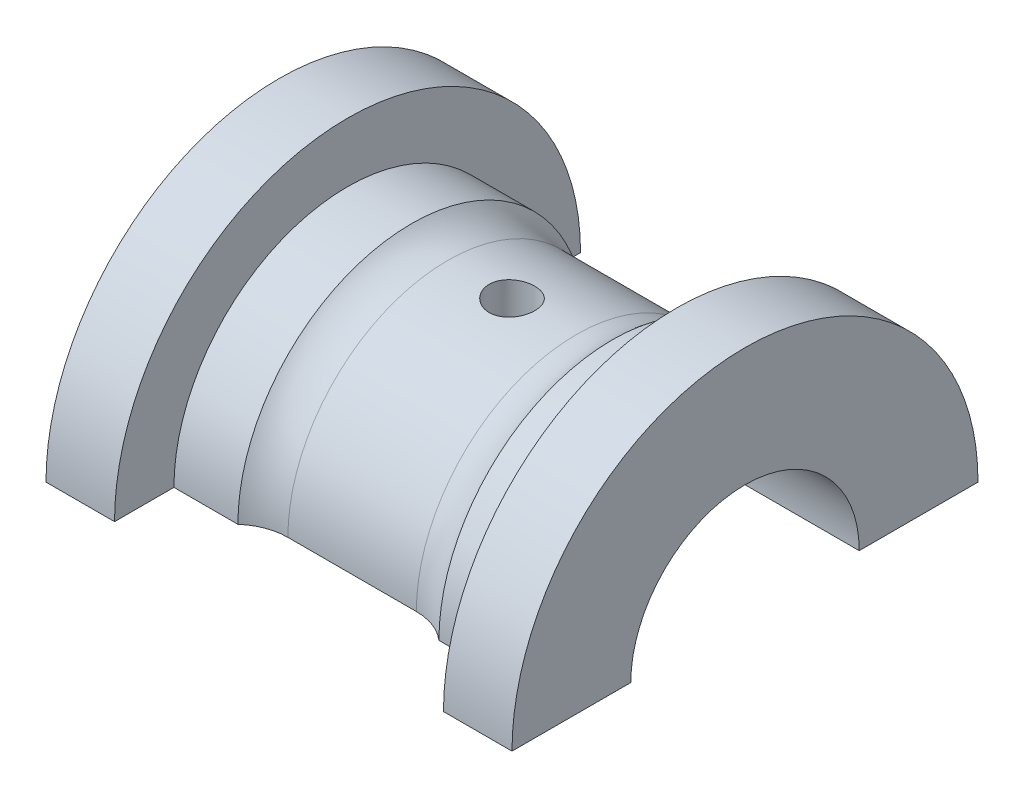
ISO-10303-21;
HEADER;
FILE_DESCRIPTION(('STEP AP214'),'2;1');
FILE_NAME('part.step','',(''),(''),'','','');
FILE_SCHEMA(('AUTOMOTIVE_DESIGN { 1 0 10303 214 1 1 1 1 }'));
ENDSEC;
DATA;
#1=APPLICATION_CONTEXT('core data for automotive mechanical design processes');
#2=APPLICATION_PROTOCOL_DEFINITION('international standard','automotive_design',2000,#1);
#3=PRODUCT_CONTEXT('',#1,'mechanical');
#4=PRODUCT('Part','Part','',(#3));
#5=PRODUCT_RELATED_PRODUCT_CATEGORY('part','',(#4));
#6=PRODUCT_DEFINITION_FORMATION('','',#4);
#7=PRODUCT_DEFINITION_CONTEXT('part definition',#1,'design');
#8=PRODUCT_DEFINITION('design','',#6,#7);
#9=PRODUCT_DEFINITION_SHAPE('','',#8);
#10=(LENGTH_UNIT() NAMED_UNIT(*) SI_UNIT(.MILLI.,.METRE.));
#11=(NAMED_UNIT(*) PLANE_ANGLE_UNIT() SI_UNIT($,.RADIAN.));
#12=(NAMED_UNIT(*) SI_UNIT($,.STERADIAN.) SOLID_ANGLE_UNIT());
#13=UNCERTAINTY_MEASURE_WITH_UNIT(LENGTH_MEASURE(1.E-05),#10,'distance_accuracy_value','');
#14=(GEOMETRIC_REPRESENTATION_CONTEXT(3) GLOBAL_UNCERTAINTY_ASSIGNED_CONTEXT((#13)) GLOBAL_UNIT_ASSIGNED_CONTEXT((#10,
#11,#12)) REPRESENTATION_CONTEXT('',''));
#15=CARTESIAN_POINT('',(0.,0.,0.));
#16=DIRECTION('',(0.,0.,1.));
#17=DIRECTION('',(1.,0.,0.));
#18=AXIS2_PLACEMENT_3D('',#15,#16,#17);
#19=CARTESIAN_POINT('',(25.5,0.,-12.5));
#20=DIRECTION('',(1.,0.,0.));
#21=DIRECTION('',(0.,0.,-1.));
#22=AXIS2_PLACEMENT_3D('',#19,#20,#21);
#23=PLANE('',#22);
#24=CARTESIAN_POINT('',(25.5,0.,0.));
#25=DIRECTION('',(1.,0.,0.));
#26=DIRECTION('',(0.,0.,-1.));
#27=AXIS2_PLACEMENT_3D('',#24,#25,#26);
#28=CIRCLE('',#27,25.5);
#29=CARTESIAN_POINT('',(25.5,0.,-25.5));
#30=VERTEX_POINT('',#29);
#31=CARTESIAN_POINT('',(25.5,0.,25.5));
#32=VERTEX_POINT('',#31);
#33=EDGE_CURVE('E120',#30,#32,#28,.T.);
#34=ORIENTED_EDGE('',*,*,#33,.T.);
#35=DIRECTION('',(0.,0.,1.));
#36=VECTOR('',#35,1.);
#37=CARTESIAN_POINT('',(25.5,0.,12.5));
#38=LINE('',#37,#36);
#39=CARTESIAN_POINT('',(25.5,0.,12.5));
#40=VERTEX_POINT('',#39);
#41=EDGE_CURVE('E122',#40,#32,#38,.T.);
#42=ORIENTED_EDGE('',*,*,#41,.F.);
#43=CARTESIAN_POINT('',(25.5,0.,0.));
#44=DIRECTION('',(1.,0.,0.));
#45=DIRECTION('',(0.,0.,-1.));
#46=AXIS2_PLACEMENT_3D('',#43,#44,#45);
#47=CIRCLE('',#46,12.5);
#48=CARTESIAN_POINT('',(25.5,0.,-12.5));
#49=VERTEX_POINT('',#48);
#50=EDGE_CURVE('E191',#49,#40,#47,.T.);
#51=ORIENTED_EDGE('',*,*,#50,.F.);
#52=DIRECTION('',(0.,0.,-1.));
#53=VECTOR('',#52,1.);
#54=CARTESIAN_POINT('',(25.5,0.,-12.5));
#55=LINE('',#54,#53);
#56=EDGE_CURVE('E125',#49,#30,#55,.T.);
#57=ORIENTED_EDGE('',*,*,#56,.T.);
#58=EDGE_LOOP('',(#34,#42,#51,#57));
#59=FACE_BOUND('',#58,.T.);
#60=ADVANCED_FACE('F33',(#59),#23,.T.);
#61=CARTESIAN_POINT('',(0.,0.,0.));
#62=DIRECTION('',(1.,0.,0.));
#63=DIRECTION('',(0.,0.,-1.));
#64=AXIS2_PLACEMENT_3D('',#61,#62,#63);
#65=CYLINDRICAL_SURFACE('',#64,25.5);
#66=CARTESIAN_POINT('',(18.,0.,0.));
#67=DIRECTION('',(1.,0.,0.));
#68=DIRECTION('',(0.,0.,-1.));
#69=AXIS2_PLACEMENT_3D('',#66,#67,#68);
#70=CIRCLE('',#69,25.5);
#71=CARTESIAN_POINT('',(18.,0.,-25.5));
#72=VERTEX_POINT('',#71);
#73=CARTESIAN_POINT('',(18.,0.,25.5));
#74=VERTEX_POINT('',#73);
#75=EDGE_CURVE('E131',#72,#74,#70,.T.);
#76=ORIENTED_EDGE('',*,*,#75,.T.);
#77=DIRECTION('',(-1.,0.,0.));
#78=VECTOR('',#77,1.);
#79=CARTESIAN_POINT('',(25.5,0.,25.5));
#80=LINE('',#79,#78);
#81=EDGE_CURVE('E136',#32,#74,#80,.T.);
#82=ORIENTED_EDGE('',*,*,#81,.F.);
#83=ORIENTED_EDGE('',*,*,#33,.F.);
#84=DIRECTION('',(-1.,0.,0.));
#85=VECTOR('',#84,1.);
#86=CARTESIAN_POINT('',(25.5,0.,-25.5));
#87=LINE('',#86,#85);
#88=EDGE_CURVE('E166',#30,#72,#87,.T.);
#89=ORIENTED_EDGE('',*,*,#88,.T.);
#90=EDGE_LOOP('',(#76,#82,#83,#89));
#91=FACE_BOUND('',#90,.T.);
#92=ADVANCED_FACE('F143',(#91),#65,.T.);
#93=CARTESIAN_POINT('',(18.,0.,-25.5));
#94=DIRECTION('',(-1.,0.,0.));
#95=DIRECTION('',(0.,0.,1.));
#96=AXIS2_PLACEMENT_3D('',#93,#94,#95);
#97=PLANE('',#96);
#98=CARTESIAN_POINT('',(18.,0.,0.));
#99=DIRECTION('',(1.,0.,0.));
#100=DIRECTION('',(0.,0.,-1.));
#101=AXIS2_PLACEMENT_3D('',#98,#99,#100);
#102=CIRCLE('',#101,19.);
#103=CARTESIAN_POINT('',(18.,0.,-19.));
#104=VERTEX_POINT('',#103);
#105=CARTESIAN_POINT('',(18.,0.,19.));
#106=VERTEX_POINT('',#105);
#107=EDGE_CURVE('E207',#104,#106,#102,.T.);
#108=ORIENTED_EDGE('',*,*,#107,.T.);
#109=DIRECTION('',(0.,0.,-1.));
#110=VECTOR('',#109,1.);
#111=CARTESIAN_POINT('',(18.,0.,25.5));
#112=LINE('',#111,#110);
#113=EDGE_CURVE('E144',#74,#106,#112,.T.);
#114=ORIENTED_EDGE('',*,*,#113,.F.);
#115=ORIENTED_EDGE('',*,*,#75,.F.);
#116=DIRECTION('',(0.,0.,1.));
#117=VECTOR('',#116,1.);
#118=CARTESIAN_POINT('',(18.,0.,-25.5));
#119=LINE('',#118,#117);
#120=EDGE_CURVE('E168',#72,#104,#119,.T.);
#121=ORIENTED_EDGE('',*,*,#120,.T.);
#122=EDGE_LOOP('',(#108,#114,#115,#121));
#123=FACE_BOUND('',#122,.T.);
#124=ADVANCED_FACE('F264',(#123),#97,.T.);
#125=CARTESIAN_POINT('',(0.,0.,0.));
#126=DIRECTION('',(1.,0.,0.));
#127=DIRECTION('',(0.,0.,-1.));
#128=AXIS2_PLACEMENT_3D('',#125,#126,#127);
#129=CYLINDRICAL_SURFACE('',#128,19.);
#130=CARTESIAN_POINT('',(11.,0.,0.));
#131=DIRECTION('',(1.,0.,0.));
#132=DIRECTION('',(0.,0.,-1.));
#133=AXIS2_PLACEMENT_3D('',#130,#131,#132);
#134=CIRCLE('',#133,19.);
#135=CARTESIAN_POINT('',(11.,0.,-19.));
#136=VERTEX_POINT('',#135);
#137=CARTESIAN_POINT('',(11.,0.,19.));
#138=VERTEX_POINT('',#137);
#139=EDGE_CURVE('E204',#136,#138,#134,.T.);
#140=ORIENTED_EDGE('',*,*,#139,.T.);
#141=DIRECTION('',(-1.,0.,0.));
#142=VECTOR('',#141,1.);
#143=CARTESIAN_POINT('',(18.,0.,19.));
#144=LINE('',#143,#142);
#145=EDGE_CURVE('E146',#106,#138,#144,.T.);
#146=ORIENTED_EDGE('',*,*,#145,.F.);
#147=ORIENTED_EDGE('',*,*,#107,.F.);
#148=DIRECTION('',(-1.,0.,0.));
#149=VECTOR('',#148,1.);
#150=CARTESIAN_POINT('',(18.,0.,-19.));
#151=LINE('',#150,#149);
#152=EDGE_CURVE('E171',#104,#136,#151,.T.);
#153=ORIENTED_EDGE('',*,*,#152,.T.);
#154=EDGE_LOOP('',(#140,#146,#147,#153));
#155=FACE_BOUND('',#154,.T.);
#156=ADVANCED_FACE('F258',(#155),#129,.T.);
#157=CARTESIAN_POINT('',(0.,0.,0.));
#158=DIRECTION('',(1.,0.,0.));
#159=DIRECTION('',(0.,0.,-1.));
#160=AXIS2_PLACEMENT_3D('',#157,#158,#159);
#161=CYLINDRICAL_SURFACE('',#160,17.5);
#162=CARTESIAN_POINT('',(0.,17.3205080756888,2.5));
#163=CARTESIAN_POINT('',(0.139655214050539,17.3205103214296,2.4999941764498));
#164=CARTESIAN_POINT('',(0.279393390965435,17.3222153996634,2.488258306336));
#165=CARTESIAN_POINT('',(0.554968295528885,17.3288474891277,2.44163425172347));
#166=CARTESIAN_POINT('',(0.690800994393877,17.3337777110364,2.40672299527128));
#167=CARTESIAN_POINT('',(0.954535875036131,17.346290533042,2.31480923545586));
#168=CARTESIAN_POINT('',(1.08244384762566,17.3538711688453,2.257823089026));
#169=CARTESIAN_POINT('',(1.32686216183505,17.3708283324759,2.12341469861513));
#170=CARTESIAN_POINT('',(1.44337418380036,17.3802045949313,2.04599547375905));
#171=CARTESIAN_POINT('',(1.66256036980916,17.3997728156945,1.87231683550245));
#172=CARTESIAN_POINT('',(1.76513964233236,17.4099696809091,1.77593820534161));
#173=CARTESIAN_POINT('',(1.95272694655073,17.4299862889805,1.56733384870893));
#174=CARTESIAN_POINT('',(2.03773404080034,17.4398060116945,1.45510727731391));
#175=CARTESIAN_POINT('',(2.1881113721996,17.4580129627861,1.21738798002561));
#176=CARTESIAN_POINT('',(2.25339464314804,17.4663937786684,1.09183970777011));
#177=CARTESIAN_POINT('',(2.36191341915977,17.4807243931613,0.83142093245387));
#178=CARTESIAN_POINT('',(2.40514998330924,17.4866743085456,0.696550877549161));
#179=CARTESIAN_POINT('',(2.46806150870533,17.4954381251122,0.422292579426188));
#180=CARTESIAN_POINT('',(2.48789508745779,17.4982731289764,0.282941406337347));
#181=CARTESIAN_POINT('',(2.50392987320825,17.5005599435479,0.00286195659799811));
#182=CARTESIAN_POINT('',(2.50013227745764,17.5000119256529,-0.137866249925724));
#183=CARTESIAN_POINT('',(2.46913827723023,17.4956113682908,-0.415623740232337));
#184=CARTESIAN_POINT('',(2.44211250139686,17.4917829266554,-0.552672499713794));
#185=CARTESIAN_POINT('',(2.36569680037599,17.4812785676579,-0.820269493910867));
#186=CARTESIAN_POINT('',(2.31630634376525,17.4746025826336,-0.950817574077354));
#187=CARTESIAN_POINT('',(2.19638656902054,17.4591117546373,-1.20222745845967));
#188=CARTESIAN_POINT('',(2.12578481110145,17.4502896021464,-1.32305424098883));
#189=CARTESIAN_POINT('',(1.96549938407467,17.4314908337029,-1.55120977517206));
#190=CARTESIAN_POINT('',(1.87581457419597,17.4215141487494,-1.65853771926479));
#191=CARTESIAN_POINT('',(1.67895674790501,17.4014150617975,-1.85765373882982));
#192=CARTESIAN_POINT('',(1.57163483406351,17.3912921538904,-1.9492946166523));
#193=CARTESIAN_POINT('',(1.34305684821314,17.3721286734458,-2.11328736987654));
#194=CARTESIAN_POINT('',(1.22180070481798,17.3630881064538,-2.18563914645223));
#195=CARTESIAN_POINT('',(0.968649637617275,17.3471131710366,-2.30901626900993));
#196=CARTESIAN_POINT('',(0.836747742646745,17.3401801971233,-2.36002750314722));
#197=CARTESIAN_POINT('',(0.566128025217641,17.3292308226119,-2.439132796354));
#198=CARTESIAN_POINT('',(0.427410637010548,17.3252142364516,-2.46722831350378));
#199=CARTESIAN_POINT('',(0.14840432821245,17.3205872594665,-2.49950488360242));
#200=CARTESIAN_POINT('',(0.0081399675055199,17.3199472150388,-2.50389413880589));
#201=CARTESIAN_POINT('',(-0.271122256281438,17.3220671566589,-2.489185103089));
#202=CARTESIAN_POINT('',(-0.410120154779111,17.3248270473289,-2.47008747104212));
#203=CARTESIAN_POINT('',(-0.682265225035558,17.3334087065645,-2.40912297319002));
#204=CARTESIAN_POINT('',(-0.815435908831676,17.3392166418156,-2.36735894805526));
#205=CARTESIAN_POINT('',(-1.07288599682062,17.3532286401521,-2.26235382714329));
#206=CARTESIAN_POINT('',(-1.19716499945215,17.3614328113701,-2.19911176212676));
#207=CARTESIAN_POINT('',(-1.43423984965186,17.3793831051677,-2.05244200414032));
#208=CARTESIAN_POINT('',(-1.54695120151545,17.3891394056538,-1.96887900033906));
#209=CARTESIAN_POINT('',(-1.75682465453189,17.4090636358241,-1.78412847276706));
#210=CARTESIAN_POINT('',(-1.85398596007391,17.4192315865368,-1.6829400477527));
#211=CARTESIAN_POINT('',(-2.03074402304225,17.4389256551739,-1.46489635785669));
#212=CARTESIAN_POINT('',(-2.1102031528994,17.4484463695232,-1.34792896515541));
#213=CARTESIAN_POINT('',(-2.24834445391965,17.4656902694975,-1.10218588096399));
#214=CARTESIAN_POINT('',(-2.30702714967244,17.4734135005061,-0.973410487720567));
#215=CARTESIAN_POINT('',(-2.40172764289464,17.4861684730555,-0.708144905742413));
#216=CARTESIAN_POINT('',(-2.43782198578436,17.4912092957152,-0.57168249890491));
#217=CARTESIAN_POINT('',(-2.48656933388326,17.4980694889566,-0.294556573807229));
#218=CARTESIAN_POINT('',(-2.49922373731731,17.4998890516906,-0.153893306642844));
#219=CARTESIAN_POINT('',(-2.50070029868059,17.5001000958988,0.126303913283943));
#220=CARTESIAN_POINT('',(-2.48973352377306,17.4985219377795,0.265836777188219));
#221=CARTESIAN_POINT('',(-2.44472981244618,17.4921758034385,0.541053291849849));
#222=CARTESIAN_POINT('',(-2.41069293049508,17.4874078347479,0.676736951694341));
#223=CARTESIAN_POINT('',(-2.32058752821484,17.4752152756766,0.940354643121523));
#224=CARTESIAN_POINT('',(-2.26453227439438,17.4677922852398,1.06829328775858));
#225=CARTESIAN_POINT('',(-2.13200356349716,17.4511070012847,1.3129821323145));
#226=CARTESIAN_POINT('',(-2.05552956867624,17.4418446593271,1.42973203745873));
#227=CARTESIAN_POINT('',(-1.88356535597192,17.4224130932707,1.64980243700276));
#228=CARTESIAN_POINT('',(-1.78791886646363,17.4122368231533,1.75300020789777));
#229=CARTESIAN_POINT('',(-1.58065304970162,17.3921777929122,1.94195895909259));
#230=CARTESIAN_POINT('',(-1.46902997123847,17.3822951023791,2.02771583289178));
#231=CARTESIAN_POINT('',(-1.23231820209395,17.3638885978291,2.17974404343878));
#232=CARTESIAN_POINT('',(-1.10716413704061,17.3553719241531,2.24591442873637));
#233=CARTESIAN_POINT('',(-0.847459629299109,17.3407453505435,2.35619878131273));
#234=CARTESIAN_POINT('',(-0.71291925211755,17.3346329177213,2.40033597402073));
#235=CARTESIAN_POINT('',(-0.481454467704522,17.3269411528971,2.4551156895733));
#236=CARTESIAN_POINT('',(-0.385969580734816,17.3245412999151,2.47192203162013));
#237=CARTESIAN_POINT('',(-0.193669753794692,17.3213239914062,2.49436614385582));
#238=CARTESIAN_POINT('',(-0.0968548286929663,17.3205065182042,2.50000403879626));
#239=CARTESIAN_POINT('',(0.,17.3205080756888,2.5));
#240=B_SPLINE_CURVE_WITH_KNOTS('',3,(#162,#163,#164,#165,#166,#167,#168,#169,#170,#171,#172,
#173,#174,#175,#176,#177,#178,#179,#180,#181,#182,#183,#184,#185,#186,#187,#188,#189,#190,#191,
#192,#193,#194,#195,#196,#197,#198,#199,#200,#201,#202,#203,#204,#205,#206,#207,#208,#209,#210,
#211,#212,#213,#214,#215,#216,#217,#218,#219,#220,#221,#222,#223,#224,#225,#226,#227,#228,#229,
#230,#231,#232,#233,#234,#235,#236,#237,#238,#239),.UNSPECIFIED.,.T.,.F.,(4,2,2,2,2,2,2,2,2,2,2,
2,2,2,2,2,2,2,2,2,2,2,2,2,2,2,2,2,2,2,2,2,2,2,2,2,2,2,4),(0.,0.418611686761216,
0.837640743157851,1.25635990174198,1.67501722635384,2.09639644561274,2.51779813893171,
2.94103163345004,3.36424479463775,3.78457277673272,4.20487946347624,4.62212481134302,
5.03938007419639,5.45807684551733,5.87679865326298,6.29925647482803,6.72171646077846,
7.14445536663837,7.56716737238593,7.98616076353199,8.40514240099881,8.82223876005372,
9.23935394391405,9.65932651264328,10.0793205622075,10.5024740190271,10.9256167907707,
11.3473177767363,11.7689936068438,12.1869171913008,12.6048397890487,13.022510965389,
13.4401931425248,13.8614293663583,14.2827646567287,14.7062351939404,15.1292583986303,
15.4195806495844,15.7098996576198),.UNSPECIFIED.);
#241=CARTESIAN_POINT('',(0.,17.3205080756888,2.5));
#242=VERTEX_POINT('',#241);
#243=EDGE_CURVE('E130',#242,#242,#240,.T.);
#244=ORIENTED_EDGE('',*,*,#243,.F.);
#245=EDGE_LOOP('',(#244));
#246=FACE_BOUND('',#245,.T.);
#247=DIRECTION('',(-1.,0.,0.));
#248=VECTOR('',#247,1.);
#249=CARTESIAN_POINT('',(11.,0.,17.5));
#250=LINE('',#249,#248);
#251=CARTESIAN_POINT('',(7.03137303340311,0.,17.5));
#252=VERTEX_POINT('',#251);
#253=CARTESIAN_POINT('',(-7.03137303340311,0.,17.5));
#254=VERTEX_POINT('',#253);
#255=EDGE_CURVE('E151',#252,#254,#250,.T.);
#256=ORIENTED_EDGE('',*,*,#255,.F.);
#257=CARTESIAN_POINT('',(7.03137303340311,0.,0.));
#258=DIRECTION('',(1.,0.,0.));
#259=DIRECTION('',(0.,0.,-1.));
#260=AXIS2_PLACEMENT_3D('',#257,#258,#259);
#261=CIRCLE('',#260,17.5);
#262=CARTESIAN_POINT('',(7.03137303340311,0.,-17.5));
#263=VERTEX_POINT('',#262);
#264=EDGE_CURVE('E54',#252,#263,#261,.F.);
#265=ORIENTED_EDGE('',*,*,#264,.T.);
#266=DIRECTION('',(-1.,0.,0.));
#267=VECTOR('',#266,1.);
#268=CARTESIAN_POINT('',(11.,0.,-17.5));
#269=LINE('',#268,#267);
#270=CARTESIAN_POINT('',(-7.03137303340311,0.,-17.5));
#271=VERTEX_POINT('',#270);
#272=EDGE_CURVE('E174',#263,#271,#269,.T.);
#273=ORIENTED_EDGE('',*,*,#272,.T.);
#274=CARTESIAN_POINT('',(-7.03137303340311,0.,0.));
#275=DIRECTION('',(-1.,0.,0.));
#276=DIRECTION('',(0.,0.,1.));
#277=AXIS2_PLACEMENT_3D('',#274,#275,#276);
#278=CIRCLE('',#277,17.5);
#279=EDGE_CURVE('E216',#271,#254,#278,.F.);
#280=ORIENTED_EDGE('',*,*,#279,.T.);
#281=EDGE_LOOP('',(#256,#265,#273,#280));
#282=FACE_BOUND('',#281,.T.);
#283=ADVANCED_FACE('F218',(#246,#282),#161,.T.);
#284=CARTESIAN_POINT('',(0.,0.,0.));
#285=DIRECTION('',(1.,0.,0.));
#286=DIRECTION('',(0.,0.,-1.));
#287=AXIS2_PLACEMENT_3D('',#284,#285,#286);
#288=CYLINDRICAL_SURFACE('',#287,19.);
#289=CARTESIAN_POINT('',(-18.,0.,0.));
#290=DIRECTION('',(1.,0.,0.));
#291=DIRECTION('',(0.,0.,-1.));
#292=AXIS2_PLACEMENT_3D('',#289,#290,#291);
#293=CIRCLE('',#292,19.);
#294=CARTESIAN_POINT('',(-18.,0.,-19.));
#295=VERTEX_POINT('',#294);
#296=CARTESIAN_POINT('',(-18.,0.,19.));
#297=VERTEX_POINT('',#296);
#298=EDGE_CURVE('E199',#295,#297,#293,.T.);
#299=ORIENTED_EDGE('',*,*,#298,.T.);
#300=DIRECTION('',(-1.,0.,0.));
#301=VECTOR('',#300,1.);
#302=CARTESIAN_POINT('',(-18.,0.,19.));
#303=LINE('',#302,#301);
#304=CARTESIAN_POINT('',(-11.,0.,19.));
#305=VERTEX_POINT('',#304);
#306=EDGE_CURVE('E153',#305,#297,#303,.T.);
#307=ORIENTED_EDGE('',*,*,#306,.F.);
#308=CARTESIAN_POINT('',(-11.,0.,0.));
#309=DIRECTION('',(1.,0.,0.));
#310=DIRECTION('',(0.,0.,-1.));
#311=AXIS2_PLACEMENT_3D('',#308,#309,#310);
#312=CIRCLE('',#311,19.);
#313=CARTESIAN_POINT('',(-11.,0.,-19.));
#314=VERTEX_POINT('',#313);
#315=EDGE_CURVE('E201',#314,#305,#312,.T.);
#316=ORIENTED_EDGE('',*,*,#315,.F.);
#317=DIRECTION('',(-1.,0.,0.));
#318=VECTOR('',#317,1.);
#319=CARTESIAN_POINT('',(-18.,0.,-19.));
#320=LINE('',#319,#318);
#321=EDGE_CURVE('E176',#314,#295,#320,.T.);
#322=ORIENTED_EDGE('',*,*,#321,.T.);
#323=EDGE_LOOP('',(#299,#307,#316,#322));
#324=FACE_BOUND('',#323,.T.);
#325=ADVANCED_FACE('F251',(#324),#288,.T.);
#326=CARTESIAN_POINT('',(-18.,0.,-25.5));
#327=DIRECTION('',(1.,0.,0.));
#328=DIRECTION('',(0.,0.,-1.));
#329=AXIS2_PLACEMENT_3D('',#326,#327,#328);
#330=PLANE('',#329);
#331=CARTESIAN_POINT('',(-18.,0.,0.));
#332=DIRECTION('',(1.,0.,0.));
#333=DIRECTION('',(0.,0.,-1.));
#334=AXIS2_PLACEMENT_3D('',#331,#332,#333);
#335=CIRCLE('',#334,25.5);
#336=CARTESIAN_POINT('',(-18.,0.,-25.5));
#337=VERTEX_POINT('',#336);
#338=CARTESIAN_POINT('',(-18.,0.,25.5));
#339=VERTEX_POINT('',#338);
#340=EDGE_CURVE('E197',#337,#339,#335,.T.);
#341=ORIENTED_EDGE('',*,*,#340,.T.);
#342=DIRECTION('',(0.,0.,1.));
#343=VECTOR('',#342,1.);
#344=CARTESIAN_POINT('',(-18.,0.,25.5));
#345=LINE('',#344,#343);
#346=EDGE_CURVE('E156',#297,#339,#345,.T.);
#347=ORIENTED_EDGE('',*,*,#346,.F.);
#348=ORIENTED_EDGE('',*,*,#298,.F.);
#349=DIRECTION('',(0.,0.,-1.));
#350=VECTOR('',#349,1.);
#351=CARTESIAN_POINT('',(-18.,0.,-25.5));
#352=LINE('',#351,#350);
#353=EDGE_CURVE('E179',#295,#337,#352,.T.);
#354=ORIENTED_EDGE('',*,*,#353,.T.);
#355=EDGE_LOOP('',(#341,#347,#348,#354));
#356=FACE_BOUND('',#355,.T.);
#357=ADVANCED_FACE('F248',(#356),#330,.T.);
#358=CARTESIAN_POINT('',(0.,0.,0.));
#359=DIRECTION('',(1.,0.,0.));
#360=DIRECTION('',(0.,0.,-1.));
#361=AXIS2_PLACEMENT_3D('',#358,#359,#360);
#362=CYLINDRICAL_SURFACE('',#361,25.5);
#363=CARTESIAN_POINT('',(-25.5,0.,0.));
#364=DIRECTION('',(1.,0.,0.));
#365=DIRECTION('',(0.,0.,-1.));
#366=AXIS2_PLACEMENT_3D('',#363,#364,#365);
#367=CIRCLE('',#366,25.5);
#368=CARTESIAN_POINT('',(-25.5,0.,-25.5));
#369=VERTEX_POINT('',#368);
#370=CARTESIAN_POINT('',(-25.5,0.,25.5));
#371=VERTEX_POINT('',#370);
#372=EDGE_CURVE('E195',#369,#371,#367,.T.);
#373=ORIENTED_EDGE('',*,*,#372,.T.);
#374=DIRECTION('',(-1.,0.,0.));
#375=VECTOR('',#374,1.);
#376=CARTESIAN_POINT('',(-25.5,0.,25.5));
#377=LINE('',#376,#375);
#378=EDGE_CURVE('E159',#339,#371,#377,.T.);
#379=ORIENTED_EDGE('',*,*,#378,.F.);
#380=ORIENTED_EDGE('',*,*,#340,.F.);
#381=DIRECTION('',(-1.,0.,0.));
#382=VECTOR('',#381,1.);
#383=CARTESIAN_POINT('',(-25.5,0.,-25.5));
#384=LINE('',#383,#382);
#385=EDGE_CURVE('E182',#337,#369,#384,.T.);
#386=ORIENTED_EDGE('',*,*,#385,.T.);
#387=EDGE_LOOP('',(#373,#379,#380,#386));
#388=FACE_BOUND('',#387,.T.);
#389=ADVANCED_FACE('F244',(#388),#362,.T.);
#390=CARTESIAN_POINT('',(-25.5,0.,-12.5));
#391=DIRECTION('',(-1.,0.,0.));
#392=DIRECTION('',(0.,0.,1.));
#393=AXIS2_PLACEMENT_3D('',#390,#391,#392);
#394=PLANE('',#393);
#395=CARTESIAN_POINT('',(-25.5,0.,0.));
#396=DIRECTION('',(1.,0.,0.));
#397=DIRECTION('',(0.,0.,-1.));
#398=AXIS2_PLACEMENT_3D('',#395,#396,#397);
#399=CIRCLE('',#398,12.5);
#400=CARTESIAN_POINT('',(-25.5,0.,-12.5));
#401=VERTEX_POINT('',#400);
#402=CARTESIAN_POINT('',(-25.5,0.,12.5));
#403=VERTEX_POINT('',#402);
#404=EDGE_CURVE('E193',#401,#403,#399,.T.);
#405=ORIENTED_EDGE('',*,*,#404,.T.);
#406=DIRECTION('',(0.,0.,-1.));
#407=VECTOR('',#406,1.);
#408=CARTESIAN_POINT('',(-25.5,0.,12.5));
#409=LINE('',#408,#407);
#410=EDGE_CURVE('E162',#371,#403,#409,.T.);
#411=ORIENTED_EDGE('',*,*,#410,.F.);
#412=ORIENTED_EDGE('',*,*,#372,.F.);
#413=DIRECTION('',(0.,0.,1.));
#414=VECTOR('',#413,1.);
#415=CARTESIAN_POINT('',(-25.5,0.,-12.5));
#416=LINE('',#415,#414);
#417=EDGE_CURVE('E185',#369,#401,#416,.T.);
#418=ORIENTED_EDGE('',*,*,#417,.T.);
#419=EDGE_LOOP('',(#405,#411,#412,#418));
#420=FACE_BOUND('',#419,.T.);
#421=ADVANCED_FACE('F240',(#420),#394,.T.);
#422=CARTESIAN_POINT('',(0.,0.,0.));
#423=DIRECTION('',(1.,0.,0.));
#424=DIRECTION('',(0.,0.,-1.));
#425=AXIS2_PLACEMENT_3D('',#422,#423,#424);
#426=CYLINDRICAL_SURFACE('',#425,12.5);
#427=CARTESIAN_POINT('',(0.,12.2474487139159,2.5));
#428=CARTESIAN_POINT('',(-0.138910938727889,12.2474514756662,2.49999486468818));
#429=CARTESIAN_POINT('',(-0.27788655833335,12.2498377067175,2.48838292929536));
#430=CARTESIAN_POINT('',(-0.551906262857829,12.2591107826219,2.4422807089571));
#431=CARTESIAN_POINT('',(-0.686947111589949,12.2660012286197,2.40777211767623));
#432=CARTESIAN_POINT('',(-0.949093258385526,12.2834718430464,2.31698945654936));
#433=CARTESIAN_POINT('',(-1.07620630383147,12.2940483405269,2.26073703538155));
#434=CARTESIAN_POINT('',(-1.31918711174239,12.3176949870165,2.12812276917626));
#435=CARTESIAN_POINT('',(-1.43505550134475,12.3307649968365,2.05176204650287));
#436=CARTESIAN_POINT('',(-1.65390250963465,12.3581324923563,1.87994768913359));
#437=CARTESIAN_POINT('',(-1.75669896970993,12.3724434459312,1.78426413978329));
#438=CARTESIAN_POINT('',(-1.94489383394745,12.400561807565,1.57701697255327));
#439=CARTESIAN_POINT('',(-2.03029101854298,12.4143691802708,1.46545224244496));
#440=CARTESIAN_POINT('',(-2.18197004407115,12.440069910439,1.22840338981064));
#441=CARTESIAN_POINT('',(-2.2480787845416,12.4519455360388,1.10280641918053));
#442=CARTESIAN_POINT('',(-2.35818734262034,12.4722934220908,0.842010375968178));
#443=CARTESIAN_POINT('',(-2.40218922975247,12.480766001103,0.706812203551382));
#444=CARTESIAN_POINT('',(-2.46626798404906,12.4932580172105,0.432541933196236));
#445=CARTESIAN_POINT('',(-2.48665244392751,12.4973346572032,0.293544348037035));
#446=CARTESIAN_POINT('',(-2.50387737959579,12.5007730295901,0.0140464210938413));
#447=CARTESIAN_POINT('',(-2.50072012411455,12.500135216319,-0.126453774579607));
#448=CARTESIAN_POINT('',(-2.47118454946111,12.4942608717129,-0.402855001858971));
#449=CARTESIAN_POINT('',(-2.44513755708038,12.489089959146,-0.538793035746174));
#450=CARTESIAN_POINT('',(-2.37108741885277,12.4748044289852,-0.804329066450751));
#451=CARTESIAN_POINT('',(-2.32308339452032,12.465689653601,-0.933926809367821));
#452=CARTESIAN_POINT('',(-2.20617489963183,12.444432400499,-1.18404865800222));
#453=CARTESIAN_POINT('',(-2.13714062223778,12.4322712043806,-1.30451043533475));
#454=CARTESIAN_POINT('',(-1.9802273069085,12.4062617368446,-1.53226261464939));
#455=CARTESIAN_POINT('',(-1.89234610057371,12.3924132713806,-1.6395514988125));
#456=CARTESIAN_POINT('',(-1.69841594472882,12.3642741091115,-1.83987857763364));
#457=CARTESIAN_POINT('',(-1.59207703317602,12.3499799114379,-1.93263579143408));
#458=CARTESIAN_POINT('',(-1.36520889387312,12.322789289969,-2.09904623294201));
#459=CARTESIAN_POINT('',(-1.24467939779201,12.3098928926137,-2.17269909931937));
#460=CARTESIAN_POINT('',(-0.992447920445487,12.2869511868231,-2.2989070370047));
#461=CARTESIAN_POINT('',(-0.860722580900845,12.2769120390887,-2.35141661944427));
#462=CARTESIAN_POINT('',(-0.590071690690021,12.2609119080318,-2.43347585406895));
#463=CARTESIAN_POINT('',(-0.451147080952289,12.2549503932107,-2.4630284986416));
#464=CARTESIAN_POINT('',(-0.172587855002387,12.2478869816957,-2.49791501509012));
#465=CARTESIAN_POINT('',(-0.0330060642241477,12.2467036764289,-2.50365464724478));
#466=CARTESIAN_POINT('',(0.24512055799921,12.2491121422213,-2.49184407077684));
#467=CARTESIAN_POINT('',(0.383665447797158,12.2527036425097,-2.4742951828061));
#468=CARTESIAN_POINT('',(0.654421600730588,12.2641808123729,-2.41675552018539));
#469=CARTESIAN_POINT('',(0.786680857589407,12.2720249753624,-2.37698155209824));
#470=CARTESIAN_POINT('',(1.04265819757185,12.2910872337916,-2.27635258827129));
#471=CARTESIAN_POINT('',(1.1663755760893,12.3023056071567,-2.21549585593294));
#472=CARTESIAN_POINT('',(1.4035327748754,12.327035149051,-2.07351035553899));
#473=CARTESIAN_POINT('',(1.51681761575207,12.3405742966226,-1.99212769495688));
#474=CARTESIAN_POINT('',(1.72827078000229,12.3683430956659,-1.81173893053178));
#475=CARTESIAN_POINT('',(1.82643754562313,12.3825728180955,-1.71273101286134));
#476=CARTESIAN_POINT('',(2.00640639796394,12.4103836467304,-1.49808068374472));
#477=CARTESIAN_POINT('',(2.08793413662499,12.4239514427171,-1.38220624732407));
#478=CARTESIAN_POINT('',(2.23036470374896,12.4486781907155,-1.13816974158689));
#479=CARTESIAN_POINT('',(2.29126839836195,12.4598372438803,-1.01000818858377));
#480=CARTESIAN_POINT('',(2.39032217936658,12.4784323515267,-0.745756702060031));
#481=CARTESIAN_POINT('',(2.42860129556563,12.4858894785651,-0.609716683695195));
#482=CARTESIAN_POINT('',(2.48172811915961,12.4963308984415,-0.332973636699778));
#483=CARTESIAN_POINT('',(2.49657864868919,12.4993157299962,-0.192271171778029));
#484=CARTESIAN_POINT('',(2.50231745240722,12.5004635113529,0.0871822347590534));
#485=CARTESIAN_POINT('',(2.49361820114057,12.4987094637332,0.225924530353735));
#486=CARTESIAN_POINT('',(2.45341512363043,12.4907510890085,0.499927578289125));
#487=CARTESIAN_POINT('',(2.42191158412967,12.4845468178608,0.635188374384306));
#488=CARTESIAN_POINT('',(2.33717751977103,12.468387459123,0.898131874362661));
#489=CARTESIAN_POINT('',(2.28399655467256,12.4584409311904,1.02583110810041));
#490=CARTESIAN_POINT('',(2.15746939667222,12.435868053092,1.27055305046517));
#491=CARTESIAN_POINT('',(2.08412161023875,12.4232414911747,1.38757491441961));
#492=CARTESIAN_POINT('',(1.91795153234679,12.3964399789185,1.60965972526479));
#493=CARTESIAN_POINT('',(1.82483415904056,12.3822433354475,1.71449929028711));
#494=CARTESIAN_POINT('',(1.62237439975307,12.3540305726966,1.90720654439627));
#495=CARTESIAN_POINT('',(1.51302817630019,12.340014496968,1.99507020802228));
#496=CARTESIAN_POINT('',(1.27980170827392,12.3135835683483,2.15223054862495));
#497=CARTESIAN_POINT('',(1.15577759719687,12.3011875892806,2.22131703654522));
#498=CARTESIAN_POINT('',(0.897668066849746,12.2796309281603,2.33756012316556));
#499=CARTESIAN_POINT('',(0.763591903282024,12.2704673131246,2.3847366149354));
#500=CARTESIAN_POINT('',(0.524343861392815,12.2582420284461,2.44667284964414));
#501=CARTESIAN_POINT('',(0.420536451215105,12.2542196228652,2.46663474630921));
#502=CARTESIAN_POINT('',(0.211165113622163,12.2488219614771,2.49330004489927));
#503=CARTESIAN_POINT('',(0.105601246888829,12.2474466144105,2.5000039039066));
#504=CARTESIAN_POINT('',(0.,12.2474487139159,2.5));
#505=B_SPLINE_CURVE_WITH_KNOTS('',3,(#427,#428,#429,#430,#431,#432,#433,#434,#435,#436,#437,
#438,#439,#440,#441,#442,#443,#444,#445,#446,#447,#448,#449,#450,#451,#452,#453,#454,#455,#456,
#457,#458,#459,#460,#461,#462,#463,#464,#465,#466,#467,#468,#469,#470,#471,#472,#473,#474,#475,
#476,#477,#478,#479,#480,#481,#482,#483,#484,#485,#486,#487,#488,#489,#490,#491,#492,#493,#494,
#495,#496,#497,#498,#499,#500,#501,#502,#503,#504),.UNSPECIFIED.,.T.,.F.,(4,2,2,2,2,2,2,2,2,2,2,
2,2,2,2,2,2,2,2,2,2,2,2,2,2,2,2,2,2,2,2,2,2,2,2,2,2,2,4),(0.,0.416346159673569,
0.833025598210741,1.24929124485146,1.66553366214966,2.08705631371092,2.50860850088555,
2.93383501093625,3.35902170616399,3.77860622207701,4.1981503029062,4.61171974083843,
5.02530572684375,5.44149810555758,5.85773839425165,6.28123366906208,6.704736953068,
7.12914657931941,7.55350087540061,7.97059394511483,8.38766336321053,8.80073354458296,
9.21383775885995,9.63232649436302,10.0508583217552,10.4758150433363,10.9007539157526,
11.3232453394662,11.7456858672907,12.1607754353671,12.5758597841689,12.9900004268863,
13.4041738033671,13.8250288006399,14.2459834722445,14.6714724644902,15.0965743772549,
15.413095090954,15.729604892137),.UNSPECIFIED.);
#506=CARTESIAN_POINT('',(0.,12.2474487139159,2.5));
#507=VERTEX_POINT('',#506);
#508=EDGE_CURVE('E141',#507,#507,#505,.T.);
#509=ORIENTED_EDGE('',*,*,#508,.F.);
#510=EDGE_LOOP('',(#509));
#511=FACE_BOUND('',#510,.T.);
#512=DIRECTION('',(1.,0.,0.));
#513=VECTOR('',#512,1.);
#514=CARTESIAN_POINT('',(-25.5,0.,-12.5));
#515=LINE('',#514,#513);
#516=EDGE_CURVE('E188',#401,#49,#515,.T.);
#517=ORIENTED_EDGE('',*,*,#516,.T.);
#518=ORIENTED_EDGE('',*,*,#50,.T.);
#519=DIRECTION('',(1.,0.,0.));
#520=VECTOR('',#519,1.);
#521=CARTESIAN_POINT('',(-25.5,0.,12.5));
#522=LINE('',#521,#520);
#523=EDGE_CURVE('E140',#403,#40,#522,.T.);
#524=ORIENTED_EDGE('',*,*,#523,.F.);
#525=ORIENTED_EDGE('',*,*,#404,.F.);
#526=EDGE_LOOP('',(#517,#518,#524,#525));
#527=FACE_BOUND('',#526,.T.);
#528=ADVANCED_FACE('F234',(#511,#527),#426,.F.);
#529=CARTESIAN_POINT('',(0.,0.,0.));
#530=DIRECTION('',(0.,1.,0.));
#531=DIRECTION('',(1.,0.,0.));
#532=AXIS2_PLACEMENT_3D('',#529,#530,#531);
#533=PLANE('',#532);
#534=ORIENTED_EDGE('',*,*,#56,.F.);
#535=ORIENTED_EDGE('',*,*,#516,.F.);
#536=ORIENTED_EDGE('',*,*,#417,.F.);
#537=ORIENTED_EDGE('',*,*,#385,.F.);
#538=ORIENTED_EDGE('',*,*,#353,.F.);
#539=ORIENTED_EDGE('',*,*,#321,.F.);
#540=CARTESIAN_POINT('',(-7.03137303340311,0.,-23.5));
#541=DIRECTION('',(0.,1.,0.));
#542=DIRECTION('',(0.,0.,1.));
#543=AXIS2_PLACEMENT_3D('',#540,#541,#542);
#544=CIRCLE('',#543,6.);
#545=EDGE_CURVE('E280',#314,#271,#544,.T.);
#546=ORIENTED_EDGE('',*,*,#545,.T.);
#547=ORIENTED_EDGE('',*,*,#272,.F.);
#548=CARTESIAN_POINT('',(7.03137303340311,0.,-23.5));
#549=DIRECTION('',(0.,1.,0.));
#550=DIRECTION('',(0.,0.,1.));
#551=AXIS2_PLACEMENT_3D('',#548,#549,#550);
#552=CIRCLE('',#551,6.);
#553=EDGE_CURVE('E11',#263,#136,#552,.T.);
#554=ORIENTED_EDGE('',*,*,#553,.T.);
#555=ORIENTED_EDGE('',*,*,#152,.F.);
#556=ORIENTED_EDGE('',*,*,#120,.F.);
#557=ORIENTED_EDGE('',*,*,#88,.F.);
#558=EDGE_LOOP('',(#534,#535,#536,#537,#538,#539,#546,#547,#554,#555,#556,#557));
#559=FACE_BOUND('',#558,.T.);
#560=ADVANCED_FACE('F239',(#559),#533,.F.);
#561=CARTESIAN_POINT('',(0.,0.,0.));
#562=DIRECTION('',(0.,-1.,0.));
#563=DIRECTION('',(1.,0.,0.));
#564=AXIS2_PLACEMENT_3D('',#561,#562,#563);
#565=PLANE('',#564);
#566=ORIENTED_EDGE('',*,*,#41,.T.);
#567=ORIENTED_EDGE('',*,*,#81,.T.);
#568=ORIENTED_EDGE('',*,*,#113,.T.);
#569=ORIENTED_EDGE('',*,*,#145,.T.);
#570=CARTESIAN_POINT('',(7.03137303340311,0.,23.5));
#571=DIRECTION('',(0.,-1.,0.));
#572=DIRECTION('',(0.,0.,-1.));
#573=AXIS2_PLACEMENT_3D('',#570,#571,#572);
#574=CIRCLE('',#573,6.);
#575=EDGE_CURVE('E41',#138,#252,#574,.F.);
#576=ORIENTED_EDGE('',*,*,#575,.T.);
#577=ORIENTED_EDGE('',*,*,#255,.T.);
#578=CARTESIAN_POINT('',(-7.03137303340311,0.,23.5));
#579=DIRECTION('',(0.,-1.,0.));
#580=DIRECTION('',(0.,0.,-1.));
#581=AXIS2_PLACEMENT_3D('',#578,#579,#580);
#582=CIRCLE('',#581,6.);
#583=EDGE_CURVE('E285',#254,#305,#582,.F.);
#584=ORIENTED_EDGE('',*,*,#583,.T.);
#585=ORIENTED_EDGE('',*,*,#306,.T.);
#586=ORIENTED_EDGE('',*,*,#346,.T.);
#587=ORIENTED_EDGE('',*,*,#378,.T.);
#588=ORIENTED_EDGE('',*,*,#410,.T.);
#589=ORIENTED_EDGE('',*,*,#523,.T.);
#590=EDGE_LOOP('',(#566,#567,#568,#569,#576,#577,#584,#585,#586,#587,#588,#589));
#591=FACE_BOUND('',#590,.T.);
#592=ADVANCED_FACE('F134',(#591),#565,.T.);
#593=CARTESIAN_POINT('',(0.,17.5,0.));
#594=DIRECTION('',(0.,1.,0.));
#595=DIRECTION('',(0.,0.,1.));
#596=AXIS2_PLACEMENT_3D('',#593,#594,#595);
#597=CYLINDRICAL_SURFACE('',#596,2.5);
#598=ORIENTED_EDGE('',*,*,#508,.T.);
#599=EDGE_LOOP('',(#598));
#600=FACE_BOUND('',#599,.T.);
#601=ORIENTED_EDGE('',*,*,#243,.T.);
#602=EDGE_LOOP('',(#601));
#603=FACE_BOUND('',#602,.T.);
#604=ADVANCED_FACE('F222',(#600,#603),#597,.F.);
#605=CARTESIAN_POINT('',(-7.03137303340311,0.,0.));
#606=DIRECTION('',(-1.,0.,0.));
#607=DIRECTION('',(0.,0.,1.));
#608=AXIS2_PLACEMENT_3D('',#605,#606,#607);
#609=TOROIDAL_SURFACE('',#608,23.5,6.);
#610=ORIENTED_EDGE('',*,*,#545,.F.);
#611=ORIENTED_EDGE('',*,*,#315,.T.);
#612=ORIENTED_EDGE('',*,*,#583,.F.);
#613=ORIENTED_EDGE('',*,*,#279,.F.);
#614=EDGE_LOOP('',(#610,#611,#612,#613));
#615=FACE_BOUND('',#614,.T.);
#616=ADVANCED_FACE('F226',(#615),#609,.F.);
#617=CARTESIAN_POINT('',(7.03137303340311,0.,0.));
#618=DIRECTION('',(1.,0.,0.));
#619=DIRECTION('',(0.,0.,-1.));
#620=AXIS2_PLACEMENT_3D('',#617,#618,#619);
#621=TOROIDAL_SURFACE('',#620,23.5,6.);
#622=ORIENTED_EDGE('',*,*,#553,.F.);
#623=ORIENTED_EDGE('',*,*,#264,.F.);
#624=ORIENTED_EDGE('',*,*,#575,.F.);
#625=ORIENTED_EDGE('',*,*,#139,.F.);
#626=EDGE_LOOP('',(#622,#623,#624,#625));
#627=FACE_BOUND('',#626,.T.);
#628=ADVANCED_FACE('F35',(#627),#621,.F.);
#629=CLOSED_SHELL('',(#60,#92,#124,#156,#283,#325,#357,#389,#421,#528,#560,#592,#604,#616,#628));
#630=MANIFOLD_SOLID_BREP('B2',#629);
#631=ADVANCED_BREP_SHAPE_REPRESENTATION('',(#18,#630),#14);
#632=SHAPE_DEFINITION_REPRESENTATION(#9,#631);
ENDSEC;
END-ISO-10303-21;
